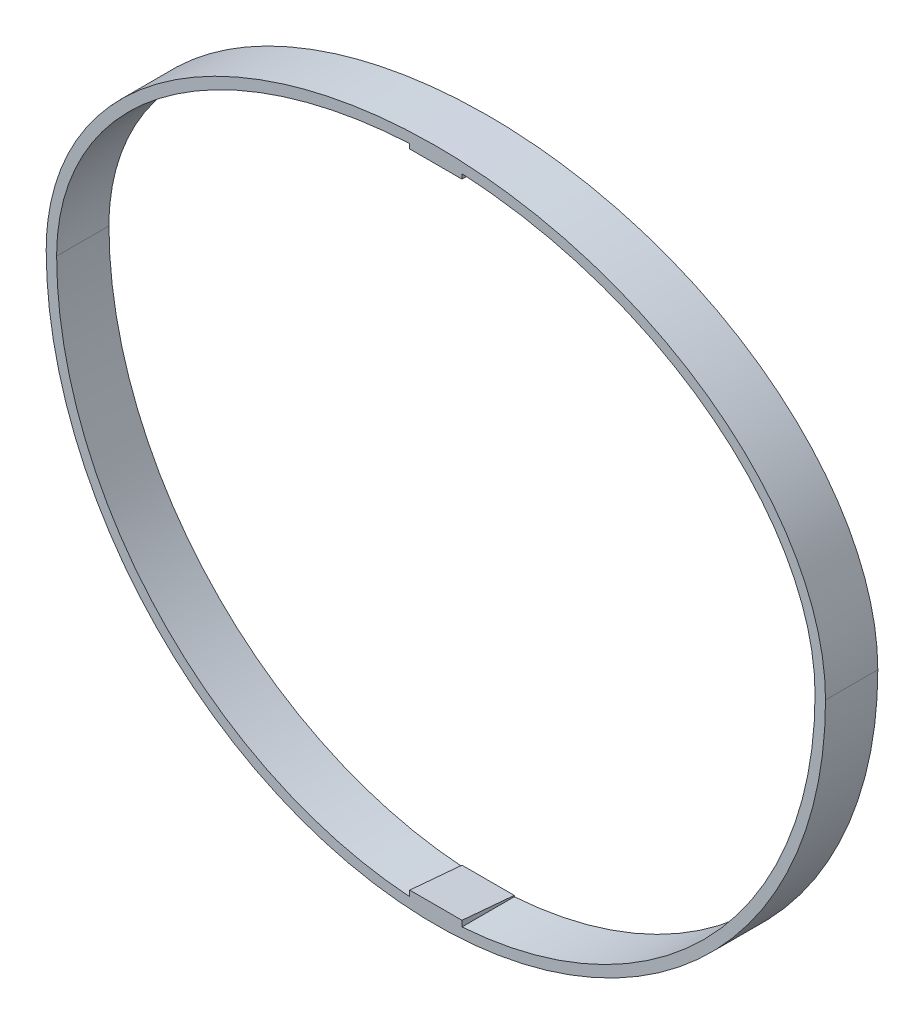
ISO-10303-21;
HEADER;
FILE_DESCRIPTION(('STEP AP214'),'2;1');
FILE_NAME('part.step','',(''),(''),'','','');
FILE_SCHEMA(('AUTOMOTIVE_DESIGN { 1 0 10303 214 1 1 1 1 }'));
ENDSEC;
DATA;
#1=APPLICATION_CONTEXT('core data for automotive mechanical design processes');
#2=APPLICATION_PROTOCOL_DEFINITION('international standard','automotive_design',2000,#1);
#3=PRODUCT_CONTEXT('',#1,'mechanical');
#4=PRODUCT('Part','Part','',(#3));
#5=PRODUCT_RELATED_PRODUCT_CATEGORY('part','',(#4));
#6=PRODUCT_DEFINITION_FORMATION('','',#4);
#7=PRODUCT_DEFINITION_CONTEXT('part definition',#1,'design');
#8=PRODUCT_DEFINITION('design','',#6,#7);
#9=PRODUCT_DEFINITION_SHAPE('','',#8);
#10=(LENGTH_UNIT() NAMED_UNIT(*) SI_UNIT(.MILLI.,.METRE.));
#11=(NAMED_UNIT(*) PLANE_ANGLE_UNIT() SI_UNIT($,.RADIAN.));
#12=(NAMED_UNIT(*) SI_UNIT($,.STERADIAN.) SOLID_ANGLE_UNIT());
#13=UNCERTAINTY_MEASURE_WITH_UNIT(LENGTH_MEASURE(1.E-05),#10,'distance_accuracy_value','');
#14=(GEOMETRIC_REPRESENTATION_CONTEXT(3) GLOBAL_UNCERTAINTY_ASSIGNED_CONTEXT((#13)) GLOBAL_UNIT_ASSIGNED_CONTEXT((#10,
#11,#12)) REPRESENTATION_CONTEXT('',''));
#15=CARTESIAN_POINT('',(0.,0.,0.));
#16=DIRECTION('',(0.,0.,1.));
#17=DIRECTION('',(1.,0.,0.));
#18=AXIS2_PLACEMENT_3D('',#15,#16,#17);
#19=CARTESIAN_POINT('',(0.,0.,12.7));
#20=DIRECTION('',(0.,0.,-1.));
#21=DIRECTION('',(-1.,0.,0.));
#22=AXIS2_PLACEMENT_3D('',#19,#20,#21);
#23=CYLINDRICAL_SURFACE('',#22,92.075);
#24=DIRECTION('',(0.,0.,-1.));
#25=VECTOR('',#24,1.);
#26=CARTESIAN_POINT('',(-6.34999999999999,-91.8557734984579,12.7));
#27=LINE('',#26,#25);
#28=CARTESIAN_POINT('',(-6.34999999999999,-91.8557734984579,0.));
#29=VERTEX_POINT('',#28);
#30=CARTESIAN_POINT('',(-6.34999999999999,-91.8557734984579,12.7));
#31=VERTEX_POINT('',#30);
#32=EDGE_CURVE('E61',#29,#31,#27,.F.);
#33=ORIENTED_EDGE('',*,*,#32,.F.);
#34=CARTESIAN_POINT('',(0.,0.,0.));
#35=DIRECTION('',(0.,0.,1.));
#36=DIRECTION('',(1.,0.,0.));
#37=AXIS2_PLACEMENT_3D('',#34,#35,#36);
#38=CIRCLE('',#37,92.075);
#39=CARTESIAN_POINT('',(-92.075,0.,0.));
#40=VERTEX_POINT('',#39);
#41=EDGE_CURVE('E241',#40,#29,#38,.T.);
#42=ORIENTED_EDGE('',*,*,#41,.F.);
#43=DIRECTION('',(0.,0.,-1.));
#44=VECTOR('',#43,1.);
#45=CARTESIAN_POINT('',(-92.075,0.,12.7));
#46=LINE('',#45,#44);
#47=CARTESIAN_POINT('',(-92.075,0.,12.7));
#48=VERTEX_POINT('',#47);
#49=EDGE_CURVE('E249',#48,#40,#46,.T.);
#50=ORIENTED_EDGE('',*,*,#49,.F.);
#51=CARTESIAN_POINT('',(0.,0.,12.7));
#52=DIRECTION('',(0.,0.,1.));
#53=DIRECTION('',(1.,0.,0.));
#54=AXIS2_PLACEMENT_3D('',#51,#52,#53);
#55=CIRCLE('',#54,92.075);
#56=EDGE_CURVE('E68',#48,#31,#55,.T.);
#57=ORIENTED_EDGE('',*,*,#56,.T.);
#58=EDGE_LOOP('',(#33,#42,#50,#57));
#59=FACE_BOUND('',#58,.T.);
#60=ADVANCED_FACE('F52',(#59),#23,.F.);
#61=CARTESIAN_POINT('',(0.,0.,12.7));
#62=DIRECTION('',(0.,0.,1.));
#63=DIRECTION('',(1.,0.,0.));
#64=AXIS2_PLACEMENT_3D('',#61,#62,#63);
#65=ELLIPSE('',#64,92.075,66.675);
#66=DIRECTION('',(0.,0.,-1.));
#67=VECTOR('',#66,1.);
#68=SURFACE_OF_LINEAR_EXTRUSION('',#65,#67);
#69=DIRECTION('',(0.,0.,-1.));
#70=VECTOR('',#69,1.);
#71=CARTESIAN_POINT('',(6.3499368190221,66.5162529375527,12.7));
#72=LINE('',#71,#70);
#73=CARTESIAN_POINT('',(6.34993681902209,66.5162529375527,0.));
#74=VERTEX_POINT('',#73);
#75=CARTESIAN_POINT('',(6.3499368190221,66.5162529375527,12.7));
#76=VERTEX_POINT('',#75);
#77=EDGE_CURVE('E279',#74,#76,#72,.F.);
#78=ORIENTED_EDGE('',*,*,#77,.F.);
#79=CARTESIAN_POINT('',(0.,0.,0.));
#80=DIRECTION('',(0.,0.,1.));
#81=DIRECTION('',(1.,0.,0.));
#82=AXIS2_PLACEMENT_3D('',#79,#80,#81);
#83=ELLIPSE('',#82,92.075,66.675);
#84=CARTESIAN_POINT('',(92.075,0.,0.));
#85=VERTEX_POINT('',#84);
#86=EDGE_CURVE('E245',#85,#74,#83,.T.);
#87=ORIENTED_EDGE('',*,*,#86,.F.);
#88=DIRECTION('',(0.,0.,-1.));
#89=VECTOR('',#88,1.);
#90=CARTESIAN_POINT('',(92.075,0.,12.7));
#91=LINE('',#90,#89);
#92=CARTESIAN_POINT('',(92.075,0.,12.7));
#93=VERTEX_POINT('',#92);
#94=EDGE_CURVE('E247',#93,#85,#91,.T.);
#95=ORIENTED_EDGE('',*,*,#94,.F.);
#96=EDGE_CURVE('E194',#93,#76,#65,.T.);
#97=ORIENTED_EDGE('',*,*,#96,.T.);
#98=EDGE_LOOP('',(#78,#87,#95,#97));
#99=FACE_BOUND('',#98,.T.);
#100=ADVANCED_FACE('F209',(#99),#68,.T.);
#101=CARTESIAN_POINT('',(-0.0164635520532582,69.2149989550233,12.7));
#102=DIRECTION('',(0.,0.,-1.));
#103=DIRECTION('',(-1.,0.,0.));
#104=AXIS2_PLACEMENT_3D('',#101,#102,#103);
#105=PLANE('',#104);
#106=DIRECTION('',(0.,-1.,0.));
#107=VECTOR('',#106,1.);
#108=CARTESIAN_POINT('',(-6.34999999999999,-91.567,12.7));
#109=LINE('',#108,#107);
#110=CARTESIAN_POINT('',(-6.34999999999999,-90.4558939732209,12.7));
#111=VERTEX_POINT('',#110);
#112=EDGE_CURVE('E142',#111,#31,#109,.T.);
#113=ORIENTED_EDGE('',*,*,#112,.T.);
#114=ORIENTED_EDGE('',*,*,#56,.F.);
#115=CARTESIAN_POINT('',(-6.35006318097762,66.5162466119064,12.7));
#116=VERTEX_POINT('',#115);
#117=EDGE_CURVE('E199',#116,#48,#65,.T.);
#118=ORIENTED_EDGE('',*,*,#117,.F.);
#119=DIRECTION('',(-9.49857786269988E-07,0.999999999999549,0.));
#120=VECTOR('',#119,1.);
#121=CARTESIAN_POINT('',(-6.35004505088884,47.4290853084628,12.7));
#122=LINE('',#121,#120);
#123=CARTESIAN_POINT('',(-6.35006211082696,65.3896035821939,12.7));
#124=VERTEX_POINT('',#123);
#125=EDGE_CURVE('E186',#124,#116,#122,.T.);
#126=ORIENTED_EDGE('',*,*,#125,.F.);
#127=DIRECTION('',(-1.,0.,0.));
#128=VECTOR('',#127,1.);
#129=CARTESIAN_POINT('',(6.34995494910543,65.3896035821939,12.7));
#130=LINE('',#129,#128);
#131=CARTESIAN_POINT('',(6.34993788917876,65.3896035821939,12.7));
#132=VERTEX_POINT('',#131);
#133=EDGE_CURVE('E178',#132,#124,#130,.T.);
#134=ORIENTED_EDGE('',*,*,#133,.F.);
#135=DIRECTION('',(-9.49857786269988E-07,0.999999999999549,0.));
#136=VECTOR('',#135,1.);
#137=CARTESIAN_POINT('',(6.34995494910543,47.4290973716566,12.7));
#138=LINE('',#137,#136);
#139=EDGE_CURVE('E179',#132,#76,#138,.T.);
#140=ORIENTED_EDGE('',*,*,#139,.T.);
#141=ORIENTED_EDGE('',*,*,#96,.F.);
#142=CARTESIAN_POINT('',(6.35000000000002,-91.8557734984579,12.7));
#143=VERTEX_POINT('',#142);
#144=EDGE_CURVE('E198',#143,#93,#55,.T.);
#145=ORIENTED_EDGE('',*,*,#144,.F.);
#146=DIRECTION('',(0.,-1.,0.));
#147=VECTOR('',#146,1.);
#148=CARTESIAN_POINT('',(6.35000000000002,-91.567,12.7));
#149=LINE('',#148,#147);
#150=CARTESIAN_POINT('',(6.35000000000002,-90.4558939732209,12.7));
#151=VERTEX_POINT('',#150);
#152=EDGE_CURVE('E151',#151,#143,#149,.T.);
#153=ORIENTED_EDGE('',*,*,#152,.F.);
#154=DIRECTION('',(1.,0.,0.));
#155=VECTOR('',#154,1.);
#156=CARTESIAN_POINT('',(-19.0985119368005,-90.4558939732209,12.7));
#157=LINE('',#156,#155);
#158=EDGE_CURVE('E154',#111,#151,#157,.T.);
#159=ORIENTED_EDGE('',*,*,#158,.F.);
#160=EDGE_LOOP('',(#113,#114,#118,#126,#134,#140,#141,#145,#153,#159));
#161=FACE_BOUND('',#160,.T.);
#162=CARTESIAN_POINT('',(94.615,0.,12.7));
#163=CARTESIAN_POINT('',(94.615,2.73261432007507,12.7));
#164=CARTESIAN_POINT('',(94.3954905250373,5.42662519263538,12.7));
#165=CARTESIAN_POINT('',(93.5440189497622,10.7421120584406,12.7));
#166=CARTESIAN_POINT('',(92.9119318766214,13.3635660736728,12.7));
#167=CARTESIAN_POINT('',(91.6604350418137,17.2423964056215,12.7));
#168=CARTESIAN_POINT('',(91.1912704189273,18.5285681655408,12.7));
#169=CARTESIAN_POINT('',(90.1687623411976,21.0437123813756,12.7));
#170=CARTESIAN_POINT('',(89.6140224491062,22.2776976934275,12.7));
#171=CARTESIAN_POINT('',(87.8263654253188,25.9127010162171,12.7));
#172=CARTESIAN_POINT('',(86.4704428821725,28.2470006963954,12.7));
#173=CARTESIAN_POINT('',(84.5858632179136,31.0619944696845,12.7));
#174=CARTESIAN_POINT('',(84.1994285419734,31.6198302429711,12.7));
#175=CARTESIAN_POINT('',(83.4077785183297,32.7253151233475,12.7));
#176=CARTESIAN_POINT('',(83.001887397005,33.2738258590577,12.7));
#177=CARTESIAN_POINT('',(81.7628980112857,34.8958271753828,12.7));
#178=CARTESIAN_POINT('',(80.9080846403538,35.9467024964426,12.7));
#179=CARTESIAN_POINT('',(78.2632315392951,39.0143439921782,12.7));
#180=CARTESIAN_POINT('',(76.3930876566904,40.9464520925132,12.7));
#181=CARTESIAN_POINT('',(72.4618047821708,44.6088151100138,12.7));
#182=CARTESIAN_POINT('',(70.4005527749216,46.3389505869222,12.7));
#183=CARTESIAN_POINT('',(67.1758169927833,48.793743065406,12.7));
#184=CARTESIAN_POINT('',(66.0787046213998,49.5885446854346,12.7));
#185=CARTESIAN_POINT('',(63.841229223158,51.1324384698243,12.7));
#186=CARTESIAN_POINT('',(62.707886546927,51.8766555542858,12.7));
#187=CARTESIAN_POINT('',(59.2727323255419,54.0270342083004,12.7));
#188=CARTESIAN_POINT('',(56.9331880287363,55.3530657890097,12.7));
#189=CARTESIAN_POINT('',(52.1645868937581,57.8104048389555,12.7));
#190=CARTESIAN_POINT('',(49.7354908435156,58.9416270068992,12.7));
#191=CARTESIAN_POINT('',(44.7936899951843,61.0221902467175,12.7));
#192=CARTESIAN_POINT('',(42.2809643232511,61.9714859099739,12.7));
#193=CARTESIAN_POINT('',(38.4517442078364,63.2646200940516,12.7));
#194=CARTESIAN_POINT('',(37.1652980054651,63.6738250647821,12.7));
#195=CARTESIAN_POINT('',(34.5725645337829,64.4490730752835,12.7));
#196=CARTESIAN_POINT('',(33.2650011401266,64.8153747797002,12.7));
#197=CARTESIAN_POINT('',(26.7215310856032,66.5289343190979,12.7));
#198=CARTESIAN_POINT('',(21.4374508149394,67.5354789536551,12.7));
#199=CARTESIAN_POINT('',(10.7786793034824,68.8790546748647,12.7));
#200=CARTESIAN_POINT('',(5.40393410077037,69.2156870433964,12.7));
#201=CARTESIAN_POINT('',(-2.72666237846473,69.2146549108367,12.7));
#202=CARTESIAN_POINT('',(-5.42478906349173,69.1294451084567,12.7));
#203=CARTESIAN_POINT('',(-10.790309057676,68.7927784565033,12.7));
#204=CARTESIAN_POINT('',(-13.4588842873476,68.5413163318492,12.7));
#205=CARTESIAN_POINT('',(-21.4219978424596,67.5372046437237,12.7));
#206=CARTESIAN_POINT('',(-26.6742828325151,66.5369324787299,12.7));
#207=CARTESIAN_POINT('',(-34.4618563752723,64.5040813044871,12.7));
#208=CARTESIAN_POINT('',(-37.0424892873095,63.7372396180026,12.7));
#209=CARTESIAN_POINT('',(-40.8888916717958,62.4431212748671,12.7));
#210=CARTESIAN_POINT('',(-42.1692199744983,61.9868017477763,12.7));
#211=CARTESIAN_POINT('',(-44.7033500903755,61.0308368286951,12.7));
#212=CARTESIAN_POINT('',(-45.9585053652892,60.5308332668305,12.7));
#213=CARTESIAN_POINT('',(-52.1737035293632,57.918806786224,12.7));
#214=CARTESIAN_POINT('',(-56.9540794964441,55.474581033303,12.7));
#215=CARTESIAN_POINT('',(-63.7947260095243,51.1982274577764,12.7));
#216=CARTESIAN_POINT('',(-66.0195800635328,49.6704133462706,12.7));
#217=CARTESIAN_POINT('',(-69.2635457809025,47.206152749294,12.7));
#218=CARTESIAN_POINT('',(-70.3277861518498,46.3567558249988,12.7));
#219=CARTESIAN_POINT('',(-72.4014506008576,44.6153096245444,12.7));
#220=CARTESIAN_POINT('',(-73.4135500973093,43.7212736716712,12.7));
#221=CARTESIAN_POINT('',(-76.3731069296007,40.9668297998488,12.7));
#222=CARTESIAN_POINT('',(-78.2441374250321,39.034382611116,12.7));
#223=CARTESIAN_POINT('',(-81.7620975798093,34.9582527501055,12.7));
#224=CARTESIAN_POINT('',(-83.4092116974869,32.8147439466343,12.7));
#225=CARTESIAN_POINT('',(-85.6877726745267,29.4183993515085,12.7));
#226=CARTESIAN_POINT('',(-86.4084578430396,28.2657692261678,12.7));
#227=CARTESIAN_POINT('',(-87.7661799033094,25.9251092567273,12.7));
#228=CARTESIAN_POINT('',(-88.4039200630446,24.7360413852743,12.7));
#229=CARTESIAN_POINT('',(-90.1900137648138,21.1109088619901,12.7));
#230=CARTESIAN_POINT('',(-91.2118311149795,18.6171844182386,12.7));
#231=CARTESIAN_POINT('',(-92.257768408783,15.3946148091232,12.7));
#232=CARTESIAN_POINT('',(-92.4553428814266,14.7448091019761,12.7));
#233=CARTESIAN_POINT('',(-92.8265577067975,13.4342914295293,12.7));
#234=CARTESIAN_POINT('',(-93.0003897484007,12.7726216282534,12.7));
#235=CARTESIAN_POINT('',(-93.4814724850508,10.7853405750973,12.7));
#236=CARTESIAN_POINT('',(-93.749581467097,9.45363525576952,12.7));
#237=CARTESIAN_POINT('',(-94.3953303029971,5.43786913705094,12.7));
#238=CARTESIAN_POINT('',(-94.615,2.7332373450719,12.7));
#239=CARTESIAN_POINT('',(-94.615,0.,12.7));
#240=B_SPLINE_CURVE_WITH_KNOTS('',3,(#162,#163,#164,#165,#166,#167,#168,#169,#170,#171,#172,
#173,#174,#175,#176,#177,#178,#179,#180,#181,#182,#183,#184,#185,#186,#187,#188,#189,#190,#191,
#192,#193,#194,#195,#196,#197,#198,#199,#200,#201,#202,#203,#204,#205,#206,#207,#208,#209,#210,
#211,#212,#213,#214,#215,#216,#217,#218,#219,#220,#221,#222,#223,#224,#225,#226,#227,#228,#229,
#230,#231,#232,#233,#234,#235,#236,#237,#238,#239),.UNSPECIFIED.,.F.,.F.,(4,2,2,2,2,2,2,2,2,2,2,
2,2,2,2,2,2,2,2,2,2,2,2,2,2,2,2,2,2,2,2,2,2,2,2,2,2,2,4),(0.,0.0312499999999998,
0.0624999999999997,0.0781249999999996,0.0937499999999995,0.124999999999999,0.132812499999999,
0.140624999999999,0.156249999999999,0.187499999999999,0.218749999999999,0.234374999999999,
0.249999999999999,0.281249999999999,0.312499999999999,0.343749999999999,0.359374999999999,
0.374999999999999,0.437499999999999,0.499999999999999,0.531249999999999,0.562499999999999,
0.624999999999999,0.656249999999999,0.671874999999999,0.687499999999999,0.749999999999999,
0.781249999999999,0.796874999999999,0.812499999999999,0.84375,0.875,0.890625,0.90625,0.9375,
0.9453125,0.953125,0.96875,1.),.UNSPECIFIED.);
#241=CARTESIAN_POINT('',(94.615,0.,12.7));
#242=VERTEX_POINT('',#241);
#243=CARTESIAN_POINT('',(-94.615,0.,12.7));
#244=VERTEX_POINT('',#243);
#245=EDGE_CURVE('E251',#242,#244,#240,.T.);
#246=ORIENTED_EDGE('',*,*,#245,.T.);
#247=CARTESIAN_POINT('',(0.,0.,12.7));
#248=DIRECTION('',(0.,0.,1.));
#249=DIRECTION('',(1.,0.,0.));
#250=AXIS2_PLACEMENT_3D('',#247,#248,#249);
#251=CIRCLE('',#250,94.615);
#252=EDGE_CURVE('E257',#244,#242,#251,.T.);
#253=ORIENTED_EDGE('',*,*,#252,.T.);
#254=EDGE_LOOP('',(#246,#253));
#255=FACE_BOUND('',#254,.T.);
#256=ADVANCED_FACE('F155',(#161,#255),#105,.F.);
#257=CARTESIAN_POINT('',(-0.0164635520532582,69.2149989550233,0.));
#258=DIRECTION('',(0.,0.,-1.));
#259=DIRECTION('',(-1.,0.,0.));
#260=AXIS2_PLACEMENT_3D('',#257,#258,#259);
#261=PLANE('',#260);
#262=ORIENTED_EDGE('',*,*,#41,.T.);
#263=DIRECTION('',(0.,-1.,0.));
#264=VECTOR('',#263,1.);
#265=CARTESIAN_POINT('',(-6.34999999999999,-91.567,0.));
#266=LINE('',#265,#264);
#267=CARTESIAN_POINT('',(-6.34999999999999,-91.567,0.));
#268=VERTEX_POINT('',#267);
#269=EDGE_CURVE('E150',#268,#29,#266,.T.);
#270=ORIENTED_EDGE('',*,*,#269,.F.);
#271=DIRECTION('',(1.,0.,0.));
#272=VECTOR('',#271,1.);
#273=CARTESIAN_POINT('',(6.35000000000001,-91.567,0.));
#274=LINE('',#273,#272);
#275=CARTESIAN_POINT('',(6.35000000000001,-91.567,0.));
#276=VERTEX_POINT('',#275);
#277=EDGE_CURVE('E160',#268,#276,#274,.T.);
#278=ORIENTED_EDGE('',*,*,#277,.T.);
#279=DIRECTION('',(0.,-1.,0.));
#280=VECTOR('',#279,1.);
#281=CARTESIAN_POINT('',(6.35000000000001,-91.567,0.));
#282=LINE('',#281,#280);
#283=CARTESIAN_POINT('',(6.35000000000001,-91.8557734984579,0.));
#284=VERTEX_POINT('',#283);
#285=EDGE_CURVE('E170',#276,#284,#282,.T.);
#286=ORIENTED_EDGE('',*,*,#285,.T.);
#287=EDGE_CURVE('E76',#284,#85,#38,.T.);
#288=ORIENTED_EDGE('',*,*,#287,.T.);
#289=ORIENTED_EDGE('',*,*,#86,.T.);
#290=DIRECTION('',(-9.49857786269988E-07,0.999999999999549,0.));
#291=VECTOR('',#290,1.);
#292=CARTESIAN_POINT('',(6.34995494910543,47.4290973716566,0.));
#293=LINE('',#292,#291);
#294=CARTESIAN_POINT('',(6.34993788917876,65.389603582194,0.));
#295=VERTEX_POINT('',#294);
#296=EDGE_CURVE('E173',#295,#74,#293,.T.);
#297=ORIENTED_EDGE('',*,*,#296,.F.);
#298=DIRECTION('',(1.,0.,0.));
#299=VECTOR('',#298,1.);
#300=CARTESIAN_POINT('',(6.34995494910543,65.389603582194,0.));
#301=LINE('',#300,#299);
#302=CARTESIAN_POINT('',(-6.35006211082697,65.389603582194,0.));
#303=VERTEX_POINT('',#302);
#304=EDGE_CURVE('E183',#303,#295,#301,.T.);
#305=ORIENTED_EDGE('',*,*,#304,.F.);
#306=DIRECTION('',(-9.49857786269988E-07,0.999999999999549,0.));
#307=VECTOR('',#306,1.);
#308=CARTESIAN_POINT('',(-6.35004505088884,47.4290853084628,0.));
#309=LINE('',#308,#307);
#310=CARTESIAN_POINT('',(-6.35006318097762,66.5162466119065,0.));
#311=VERTEX_POINT('',#310);
#312=EDGE_CURVE('E188',#303,#311,#309,.T.);
#313=ORIENTED_EDGE('',*,*,#312,.T.);
#314=EDGE_CURVE('E193',#311,#40,#83,.T.);
#315=ORIENTED_EDGE('',*,*,#314,.T.);
#316=EDGE_LOOP('',(#262,#270,#278,#286,#288,#289,#297,#305,#313,#315));
#317=FACE_BOUND('',#316,.T.);
#318=CARTESIAN_POINT('',(94.615,0.,0.));
#319=CARTESIAN_POINT('',(94.615,2.73261432007507,0.));
#320=CARTESIAN_POINT('',(94.3954905250373,5.42662519263538,0.));
#321=CARTESIAN_POINT('',(93.5440189497622,10.7421120584406,0.));
#322=CARTESIAN_POINT('',(92.9119318766214,13.3635660736728,0.));
#323=CARTESIAN_POINT('',(91.6604350418137,17.2423964056215,0.));
#324=CARTESIAN_POINT('',(91.1912704189273,18.5285681655408,0.));
#325=CARTESIAN_POINT('',(90.1687623411976,21.0437123813756,0.));
#326=CARTESIAN_POINT('',(89.6140224491062,22.2776976934275,0.));
#327=CARTESIAN_POINT('',(87.8263654253188,25.9127010162171,0.));
#328=CARTESIAN_POINT('',(86.4704428821725,28.2470006963954,0.));
#329=CARTESIAN_POINT('',(84.5858632179136,31.0619944696845,0.));
#330=CARTESIAN_POINT('',(84.1994285419734,31.6198302429711,0.));
#331=CARTESIAN_POINT('',(83.4077785183297,32.7253151233475,0.));
#332=CARTESIAN_POINT('',(83.001887397005,33.2738258590577,0.));
#333=CARTESIAN_POINT('',(81.7628980112857,34.8958271753828,0.));
#334=CARTESIAN_POINT('',(80.9080846403538,35.9467024964426,0.));
#335=CARTESIAN_POINT('',(78.2632315392951,39.0143439921782,0.));
#336=CARTESIAN_POINT('',(76.3930876566904,40.9464520925132,0.));
#337=CARTESIAN_POINT('',(72.4618047821708,44.6088151100138,0.));
#338=CARTESIAN_POINT('',(70.4005527749216,46.3389505869222,0.));
#339=CARTESIAN_POINT('',(67.1758169927833,48.793743065406,0.));
#340=CARTESIAN_POINT('',(66.0787046213998,49.5885446854346,0.));
#341=CARTESIAN_POINT('',(63.841229223158,51.1324384698243,0.));
#342=CARTESIAN_POINT('',(62.707886546927,51.8766555542858,0.));
#343=CARTESIAN_POINT('',(59.2727323255419,54.0270342083004,0.));
#344=CARTESIAN_POINT('',(56.9331880287363,55.3530657890097,0.));
#345=CARTESIAN_POINT('',(52.1645868937581,57.8104048389555,0.));
#346=CARTESIAN_POINT('',(49.7354908435156,58.9416270068992,0.));
#347=CARTESIAN_POINT('',(44.7936899951843,61.0221902467175,0.));
#348=CARTESIAN_POINT('',(42.2809643232511,61.9714859099739,0.));
#349=CARTESIAN_POINT('',(38.4517442078364,63.2646200940516,0.));
#350=CARTESIAN_POINT('',(37.1652980054651,63.6738250647821,0.));
#351=CARTESIAN_POINT('',(34.5725645337829,64.4490730752835,0.));
#352=CARTESIAN_POINT('',(33.2650011401266,64.8153747797002,0.));
#353=CARTESIAN_POINT('',(26.7215310856032,66.5289343190979,0.));
#354=CARTESIAN_POINT('',(21.4374508149394,67.5354789536551,0.));
#355=CARTESIAN_POINT('',(10.7786793034824,68.8790546748647,0.));
#356=CARTESIAN_POINT('',(5.40393410077037,69.2156870433964,0.));
#357=CARTESIAN_POINT('',(-2.72666237846473,69.2146549108367,0.));
#358=CARTESIAN_POINT('',(-5.42478906349173,69.1294451084567,0.));
#359=CARTESIAN_POINT('',(-10.790309057676,68.7927784565033,0.));
#360=CARTESIAN_POINT('',(-13.4588842873476,68.5413163318492,0.));
#361=CARTESIAN_POINT('',(-21.4219978424596,67.5372046437237,0.));
#362=CARTESIAN_POINT('',(-26.6742828325151,66.5369324787299,0.));
#363=CARTESIAN_POINT('',(-34.4618563752723,64.5040813044871,0.));
#364=CARTESIAN_POINT('',(-37.0424892873095,63.7372396180026,0.));
#365=CARTESIAN_POINT('',(-40.8888916717958,62.4431212748671,0.));
#366=CARTESIAN_POINT('',(-42.1692199744983,61.9868017477763,0.));
#367=CARTESIAN_POINT('',(-44.7033500903755,61.0308368286951,0.));
#368=CARTESIAN_POINT('',(-45.9585053652892,60.5308332668305,0.));
#369=CARTESIAN_POINT('',(-52.1737035293632,57.918806786224,0.));
#370=CARTESIAN_POINT('',(-56.9540794964441,55.474581033303,0.));
#371=CARTESIAN_POINT('',(-63.7947260095243,51.1982274577764,0.));
#372=CARTESIAN_POINT('',(-66.0195800635328,49.6704133462706,0.));
#373=CARTESIAN_POINT('',(-69.2635457809025,47.206152749294,0.));
#374=CARTESIAN_POINT('',(-70.3277861518498,46.3567558249988,0.));
#375=CARTESIAN_POINT('',(-72.4014506008576,44.6153096245444,0.));
#376=CARTESIAN_POINT('',(-73.4135500973093,43.7212736716712,0.));
#377=CARTESIAN_POINT('',(-76.3731069296007,40.9668297998488,0.));
#378=CARTESIAN_POINT('',(-78.2441374250321,39.034382611116,0.));
#379=CARTESIAN_POINT('',(-81.7620975798093,34.9582527501055,0.));
#380=CARTESIAN_POINT('',(-83.4092116974869,32.8147439466343,0.));
#381=CARTESIAN_POINT('',(-85.6877726745267,29.4183993515085,0.));
#382=CARTESIAN_POINT('',(-86.4084578430396,28.2657692261678,0.));
#383=CARTESIAN_POINT('',(-87.7661799033094,25.9251092567273,0.));
#384=CARTESIAN_POINT('',(-88.4039200630446,24.7360413852743,0.));
#385=CARTESIAN_POINT('',(-90.1900137648138,21.1109088619901,0.));
#386=CARTESIAN_POINT('',(-91.2118311149795,18.6171844182386,0.));
#387=CARTESIAN_POINT('',(-92.257768408783,15.3946148091232,0.));
#388=CARTESIAN_POINT('',(-92.4553428814266,14.7448091019761,0.));
#389=CARTESIAN_POINT('',(-92.8265577067975,13.4342914295293,0.));
#390=CARTESIAN_POINT('',(-93.0003897484007,12.7726216282534,0.));
#391=CARTESIAN_POINT('',(-93.4814724850508,10.7853405750973,0.));
#392=CARTESIAN_POINT('',(-93.749581467097,9.45363525576952,0.));
#393=CARTESIAN_POINT('',(-94.3953303029971,5.43786913705094,0.));
#394=CARTESIAN_POINT('',(-94.615,2.7332373450719,0.));
#395=CARTESIAN_POINT('',(-94.615,0.,0.));
#396=B_SPLINE_CURVE_WITH_KNOTS('',3,(#318,#319,#320,#321,#322,#323,#324,#325,#326,#327,#328,
#329,#330,#331,#332,#333,#334,#335,#336,#337,#338,#339,#340,#341,#342,#343,#344,#345,#346,#347,
#348,#349,#350,#351,#352,#353,#354,#355,#356,#357,#358,#359,#360,#361,#362,#363,#364,#365,#366,
#367,#368,#369,#370,#371,#372,#373,#374,#375,#376,#377,#378,#379,#380,#381,#382,#383,#384,#385,
#386,#387,#388,#389,#390,#391,#392,#393,#394,#395),.UNSPECIFIED.,.F.,.F.,(4,2,2,2,2,2,2,2,2,2,2,
2,2,2,2,2,2,2,2,2,2,2,2,2,2,2,2,2,2,2,2,2,2,2,2,2,2,2,4),(0.,0.0312499999999998,
0.0624999999999997,0.0781249999999996,0.0937499999999995,0.124999999999999,0.132812499999999,
0.140624999999999,0.156249999999999,0.187499999999999,0.218749999999999,0.234374999999999,
0.249999999999999,0.281249999999999,0.312499999999999,0.343749999999999,0.359374999999999,
0.374999999999999,0.437499999999999,0.499999999999999,0.531249999999999,0.562499999999999,
0.624999999999999,0.656249999999999,0.671874999999999,0.687499999999999,0.749999999999999,
0.781249999999999,0.796874999999999,0.812499999999999,0.84375,0.875,0.890625,0.90625,0.9375,
0.9453125,0.953125,0.96875,1.),.UNSPECIFIED.);
#397=CARTESIAN_POINT('',(94.615,0.,0.));
#398=VERTEX_POINT('',#397);
#399=CARTESIAN_POINT('',(-94.615,0.,0.));
#400=VERTEX_POINT('',#399);
#401=EDGE_CURVE('E250',#398,#400,#396,.T.);
#402=ORIENTED_EDGE('',*,*,#401,.F.);
#403=CARTESIAN_POINT('',(0.,0.,0.));
#404=DIRECTION('',(0.,0.,1.));
#405=DIRECTION('',(1.,0.,0.));
#406=AXIS2_PLACEMENT_3D('',#403,#404,#405);
#407=CIRCLE('',#406,94.615);
#408=EDGE_CURVE('E258',#400,#398,#407,.T.);
#409=ORIENTED_EDGE('',*,*,#408,.F.);
#410=EDGE_LOOP('',(#402,#409));
#411=FACE_BOUND('',#410,.T.);
#412=ADVANCED_FACE('F213',(#317,#411),#261,.T.);
#413=DIRECTION('',(0.,0.,-1.));
#414=VECTOR('',#413,1.);
#415=SURFACE_OF_LINEAR_EXTRUSION('',#240,#414);
#416=ORIENTED_EDGE('',*,*,#401,.T.);
#417=DIRECTION('',(0.,0.,-1.));
#418=VECTOR('',#417,1.);
#419=CARTESIAN_POINT('',(-94.615,0.,12.7));
#420=LINE('',#419,#418);
#421=EDGE_CURVE('E274',#244,#400,#420,.T.);
#422=ORIENTED_EDGE('',*,*,#421,.F.);
#423=ORIENTED_EDGE('',*,*,#245,.F.);
#424=DIRECTION('',(0.,0.,-1.));
#425=VECTOR('',#424,1.);
#426=CARTESIAN_POINT('',(94.615,0.,12.7));
#427=LINE('',#426,#425);
#428=EDGE_CURVE('E263',#242,#398,#427,.T.);
#429=ORIENTED_EDGE('',*,*,#428,.T.);
#430=EDGE_LOOP('',(#416,#422,#423,#429));
#431=FACE_BOUND('',#430,.T.);
#432=ADVANCED_FACE('F54',(#431),#415,.F.);
#433=CARTESIAN_POINT('',(0.,0.,12.7));
#434=DIRECTION('',(0.,0.,-1.));
#435=DIRECTION('',(-1.,0.,0.));
#436=AXIS2_PLACEMENT_3D('',#433,#434,#435);
#437=CYLINDRICAL_SURFACE('',#436,94.615);
#438=ORIENTED_EDGE('',*,*,#408,.T.);
#439=ORIENTED_EDGE('',*,*,#428,.F.);
#440=ORIENTED_EDGE('',*,*,#252,.F.);
#441=ORIENTED_EDGE('',*,*,#421,.T.);
#442=EDGE_LOOP('',(#438,#439,#440,#441));
#443=FACE_BOUND('',#442,.T.);
#444=ADVANCED_FACE('F207',(#443),#437,.T.);
#445=DIRECTION('',(0.,0.,-1.));
#446=VECTOR('',#445,1.);
#447=CARTESIAN_POINT('',(-6.35006318097762,66.5162466119064,12.7));
#448=LINE('',#447,#446);
#449=EDGE_CURVE('E277',#116,#311,#448,.T.);
#450=ORIENTED_EDGE('',*,*,#449,.F.);
#451=ORIENTED_EDGE('',*,*,#117,.T.);
#452=ORIENTED_EDGE('',*,*,#49,.T.);
#453=ORIENTED_EDGE('',*,*,#314,.F.);
#454=EDGE_LOOP('',(#450,#451,#452,#453));
#455=FACE_BOUND('',#454,.T.);
#456=ADVANCED_FACE('F202',(#455),#68,.T.);
#457=DIRECTION('',(0.,0.,-1.));
#458=VECTOR('',#457,1.);
#459=CARTESIAN_POINT('',(6.35000000000002,-91.8557734984579,12.7));
#460=LINE('',#459,#458);
#461=EDGE_CURVE('E12',#143,#284,#460,.T.);
#462=ORIENTED_EDGE('',*,*,#461,.F.);
#463=ORIENTED_EDGE('',*,*,#144,.T.);
#464=ORIENTED_EDGE('',*,*,#94,.T.);
#465=ORIENTED_EDGE('',*,*,#287,.F.);
#466=EDGE_LOOP('',(#462,#463,#464,#465));
#467=FACE_BOUND('',#466,.T.);
#468=ADVANCED_FACE('F206',(#467),#23,.F.);
#469=CARTESIAN_POINT('',(6.34995494910543,47.4290973716566,0.));
#470=DIRECTION('',(0.999999999999549,9.49857786269988E-07,0.));
#471=DIRECTION('',(-9.49857786269988E-07,0.999999999999549,0.));
#472=AXIS2_PLACEMENT_3D('',#469,#470,#471);
#473=PLANE('',#472);
#474=ORIENTED_EDGE('',*,*,#296,.T.);
#475=ORIENTED_EDGE('',*,*,#77,.T.);
#476=ORIENTED_EDGE('',*,*,#139,.F.);
#477=DIRECTION('',(0.,0.,1.));
#478=VECTOR('',#477,1.);
#479=CARTESIAN_POINT('',(6.34993788917876,65.389603582194,0.));
#480=LINE('',#479,#478);
#481=EDGE_CURVE('E181',#295,#132,#480,.T.);
#482=ORIENTED_EDGE('',*,*,#481,.F.);
#483=EDGE_LOOP('',(#474,#475,#476,#482));
#484=FACE_BOUND('',#483,.T.);
#485=ADVANCED_FACE('F228',(#484),#473,.T.);
#486=CARTESIAN_POINT('',(-6.35004505088884,47.4290853084628,0.));
#487=DIRECTION('',(-0.999999999999549,-9.49857786269988E-07,0.));
#488=DIRECTION('',(9.49857786269988E-07,-0.999999999999549,0.));
#489=AXIS2_PLACEMENT_3D('',#486,#487,#488);
#490=PLANE('',#489);
#491=ORIENTED_EDGE('',*,*,#125,.T.);
#492=ORIENTED_EDGE('',*,*,#449,.T.);
#493=ORIENTED_EDGE('',*,*,#312,.F.);
#494=DIRECTION('',(0.,0.,-1.));
#495=VECTOR('',#494,1.);
#496=CARTESIAN_POINT('',(-6.35006211082697,65.389603582194,0.));
#497=LINE('',#496,#495);
#498=EDGE_CURVE('E176',#124,#303,#497,.T.);
#499=ORIENTED_EDGE('',*,*,#498,.F.);
#500=EDGE_LOOP('',(#491,#492,#493,#499));
#501=FACE_BOUND('',#500,.T.);
#502=ADVANCED_FACE('F232',(#501),#490,.T.);
#503=CARTESIAN_POINT('',(-2.77454413610823E-13,65.3896035821941,-86.9281780831231));
#504=DIRECTION('',(0.,1.,0.));
#505=DIRECTION('',(1.,0.,0.));
#506=AXIS2_PLACEMENT_3D('',#503,#504,#505);
#507=PLANE('',#506);
#508=ORIENTED_EDGE('',*,*,#481,.T.);
#509=ORIENTED_EDGE('',*,*,#133,.T.);
#510=ORIENTED_EDGE('',*,*,#498,.T.);
#511=ORIENTED_EDGE('',*,*,#304,.T.);
#512=EDGE_LOOP('',(#508,#509,#510,#511));
#513=FACE_BOUND('',#512,.T.);
#514=ADVANCED_FACE('F292',(#513),#507,.F.);
#515=CARTESIAN_POINT('',(6.35000000000001,-91.567,0.));
#516=DIRECTION('',(1.,0.,0.));
#517=DIRECTION('',(0.,0.,-1.));
#518=AXIS2_PLACEMENT_3D('',#515,#516,#517);
#519=PLANE('',#518);
#520=ORIENTED_EDGE('',*,*,#152,.T.);
#521=ORIENTED_EDGE('',*,*,#461,.T.);
#522=ORIENTED_EDGE('',*,*,#285,.F.);
#523=DIRECTION('',(0.,0.0871557427476504,0.996194698091746));
#524=VECTOR('',#523,1.);
#525=CARTESIAN_POINT('',(6.35000000000002,-90.4558939732209,12.7));
#526=LINE('',#525,#524);
#527=EDGE_CURVE('E165',#276,#151,#526,.T.);
#528=ORIENTED_EDGE('',*,*,#527,.T.);
#529=EDGE_LOOP('',(#520,#521,#522,#528));
#530=FACE_BOUND('',#529,.T.);
#531=ADVANCED_FACE('F237',(#530),#519,.T.);
#532=CARTESIAN_POINT('',(-6.34999999999999,-91.567,0.));
#533=DIRECTION('',(-1.,0.,0.));
#534=DIRECTION('',(0.,0.,1.));
#535=AXIS2_PLACEMENT_3D('',#532,#533,#534);
#536=PLANE('',#535);
#537=ORIENTED_EDGE('',*,*,#269,.T.);
#538=ORIENTED_EDGE('',*,*,#32,.T.);
#539=ORIENTED_EDGE('',*,*,#112,.F.);
#540=DIRECTION('',(0.,0.0871557427476504,0.996194698091746));
#541=VECTOR('',#540,1.);
#542=CARTESIAN_POINT('',(-6.34999999999999,-90.4558939732209,12.7));
#543=LINE('',#542,#541);
#544=EDGE_CURVE('E147',#268,#111,#543,.T.);
#545=ORIENTED_EDGE('',*,*,#544,.F.);
#546=EDGE_LOOP('',(#537,#538,#539,#545));
#547=FACE_BOUND('',#546,.T.);
#548=ADVANCED_FACE('F145',(#547),#536,.T.);
#549=CARTESIAN_POINT('',(-19.0985119368005,-90.4558939732209,12.7));
#550=DIRECTION('',(0.,0.996194698091746,-0.0871557427476504));
#551=DIRECTION('',(0.,0.0871557427476504,0.996194698091746));
#552=AXIS2_PLACEMENT_3D('',#549,#550,#551);
#553=PLANE('',#552);
#554=ORIENTED_EDGE('',*,*,#277,.F.);
#555=ORIENTED_EDGE('',*,*,#544,.T.);
#556=ORIENTED_EDGE('',*,*,#158,.T.);
#557=ORIENTED_EDGE('',*,*,#527,.F.);
#558=EDGE_LOOP('',(#554,#555,#556,#557));
#559=FACE_BOUND('',#558,.T.);
#560=ADVANCED_FACE('F162',(#559),#553,.T.);
#561=CLOSED_SHELL('',(#60,#100,#256,#412,#432,#444,#456,#468,#485,#502,#514,#531,#548,#560));
#562=MANIFOLD_SOLID_BREP('B2',#561);
#563=ADVANCED_BREP_SHAPE_REPRESENTATION('',(#18,#562),#14);
#564=SHAPE_DEFINITION_REPRESENTATION(#9,#563);
ENDSEC;
END-ISO-10303-21;
